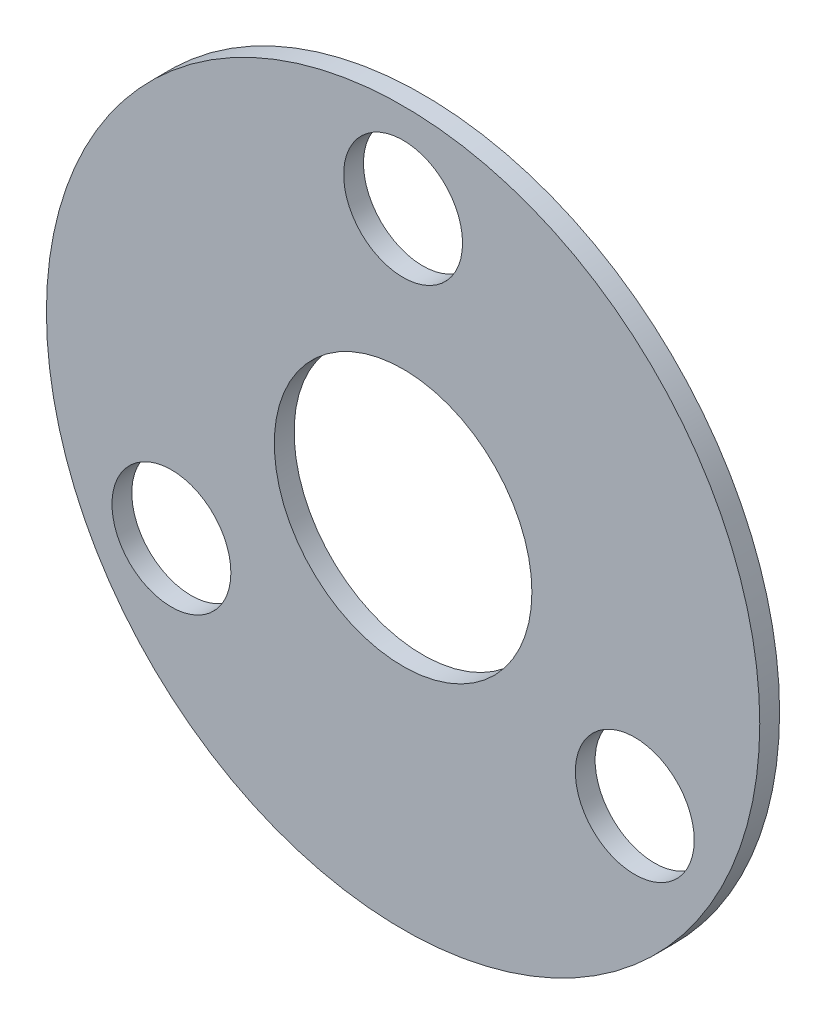
ISO-10303-21;
HEADER;
FILE_DESCRIPTION(('STEP AP214'),'2;1');
FILE_NAME('part.step','',(''),(''),'','','');
FILE_SCHEMA(('AUTOMOTIVE_DESIGN { 1 0 10303 214 1 1 1 1 }'));
ENDSEC;
DATA;
#1=APPLICATION_CONTEXT('core data for automotive mechanical design processes');
#2=APPLICATION_PROTOCOL_DEFINITION('international standard','automotive_design',2000,#1);
#3=PRODUCT_CONTEXT('',#1,'mechanical');
#4=PRODUCT('Part','Part','',(#3));
#5=PRODUCT_RELATED_PRODUCT_CATEGORY('part','',(#4));
#6=PRODUCT_DEFINITION_FORMATION('','',#4);
#7=PRODUCT_DEFINITION_CONTEXT('part definition',#1,'design');
#8=PRODUCT_DEFINITION('design','',#6,#7);
#9=PRODUCT_DEFINITION_SHAPE('','',#8);
#10=(LENGTH_UNIT() NAMED_UNIT(*) SI_UNIT(.MILLI.,.METRE.));
#11=(NAMED_UNIT(*) PLANE_ANGLE_UNIT() SI_UNIT($,.RADIAN.));
#12=(NAMED_UNIT(*) SI_UNIT($,.STERADIAN.) SOLID_ANGLE_UNIT());
#13=UNCERTAINTY_MEASURE_WITH_UNIT(LENGTH_MEASURE(1.E-05),#10,'distance_accuracy_value','');
#14=(GEOMETRIC_REPRESENTATION_CONTEXT(3) GLOBAL_UNCERTAINTY_ASSIGNED_CONTEXT((#13)) GLOBAL_UNIT_ASSIGNED_CONTEXT((#10,
#11,#12)) REPRESENTATION_CONTEXT('',''));
#15=CARTESIAN_POINT('',(0.,0.,0.));
#16=DIRECTION('',(0.,0.,1.));
#17=DIRECTION('',(1.,0.,0.));
#18=AXIS2_PLACEMENT_3D('',#15,#16,#17);
#19=CARTESIAN_POINT('',(0.,0.,1.));
#20=DIRECTION('',(0.,0.,-1.));
#21=DIRECTION('',(-1.,0.,0.));
#22=AXIS2_PLACEMENT_3D('',#19,#20,#21);
#23=CYLINDRICAL_SURFACE('',#22,18.);
#24=CARTESIAN_POINT('',(0.,0.,1.));
#25=DIRECTION('',(0.,0.,1.));
#26=DIRECTION('',(1.,0.,0.));
#27=AXIS2_PLACEMENT_3D('',#24,#25,#26);
#28=CIRCLE('',#27,18.);
#29=CARTESIAN_POINT('',(18.,0.,1.));
#30=VERTEX_POINT('',#29);
#31=EDGE_CURVE('E10',#30,#30,#28,.T.);
#32=ORIENTED_EDGE('',*,*,#31,.F.);
#33=EDGE_LOOP('',(#32));
#34=FACE_BOUND('',#33,.T.);
#35=CARTESIAN_POINT('',(0.,0.,0.));
#36=DIRECTION('',(0.,0.,1.));
#37=DIRECTION('',(1.,0.,0.));
#38=AXIS2_PLACEMENT_3D('',#35,#36,#37);
#39=CIRCLE('',#38,18.);
#40=CARTESIAN_POINT('',(18.,0.,0.));
#41=VERTEX_POINT('',#40);
#42=EDGE_CURVE('E34',#41,#41,#39,.T.);
#43=ORIENTED_EDGE('',*,*,#42,.T.);
#44=EDGE_LOOP('',(#43));
#45=FACE_BOUND('',#44,.T.);
#46=ADVANCED_FACE('F31',(#34,#45),#23,.T.);
#47=CARTESIAN_POINT('',(0.,0.,1.));
#48=DIRECTION('',(0.,0.,1.));
#49=DIRECTION('',(1.,0.,0.));
#50=AXIS2_PLACEMENT_3D('',#47,#48,#49);
#51=PLANE('',#50);
#52=CARTESIAN_POINT('',(0.,0.,1.));
#53=DIRECTION('',(0.,0.,1.));
#54=DIRECTION('',(1.,0.,0.));
#55=AXIS2_PLACEMENT_3D('',#52,#53,#54);
#56=CIRCLE('',#55,6.5);
#57=CARTESIAN_POINT('',(6.5,0.,1.));
#58=VERTEX_POINT('',#57);
#59=EDGE_CURVE('E58',#58,#58,#56,.T.);
#60=ORIENTED_EDGE('',*,*,#59,.F.);
#61=EDGE_LOOP('',(#60));
#62=FACE_BOUND('',#61,.T.);
#63=CARTESIAN_POINT('',(11.6913429510905,-6.74999999999967,1.));
#64=DIRECTION('',(0.,0.,1.));
#65=DIRECTION('',(1.,0.,0.));
#66=AXIS2_PLACEMENT_3D('',#63,#64,#65);
#67=CIRCLE('',#66,3.00000000000052);
#68=CARTESIAN_POINT('',(14.691342951091,-6.74999999999967,1.));
#69=VERTEX_POINT('',#68);
#70=EDGE_CURVE('E52',#69,#69,#67,.T.);
#71=ORIENTED_EDGE('',*,*,#70,.F.);
#72=EDGE_LOOP('',(#71));
#73=FACE_BOUND('',#72,.T.);
#74=CARTESIAN_POINT('',(-11.6913429510893,-6.75000000000034,1.));
#75=DIRECTION('',(0.,0.,1.));
#76=DIRECTION('',(1.,0.,0.));
#77=AXIS2_PLACEMENT_3D('',#74,#75,#76);
#78=CIRCLE('',#77,3.00000000000077);
#79=CARTESIAN_POINT('',(-8.69134295108858,-6.75000000000034,1.));
#80=VERTEX_POINT('',#79);
#81=EDGE_CURVE('E46',#80,#80,#78,.T.);
#82=ORIENTED_EDGE('',*,*,#81,.F.);
#83=EDGE_LOOP('',(#82));
#84=FACE_BOUND('',#83,.T.);
#85=CARTESIAN_POINT('',(0.,13.5,1.));
#86=DIRECTION('',(0.,0.,1.));
#87=DIRECTION('',(1.,0.,0.));
#88=AXIS2_PLACEMENT_3D('',#85,#86,#87);
#89=CIRCLE('',#88,3.);
#90=CARTESIAN_POINT('',(3.,13.5,1.));
#91=VERTEX_POINT('',#90);
#92=EDGE_CURVE('E43',#91,#91,#89,.T.);
#93=ORIENTED_EDGE('',*,*,#92,.F.);
#94=EDGE_LOOP('',(#93));
#95=FACE_BOUND('',#94,.T.);
#96=ORIENTED_EDGE('',*,*,#31,.T.);
#97=EDGE_LOOP('',(#96));
#98=FACE_BOUND('',#97,.T.);
#99=ADVANCED_FACE('F69',(#62,#73,#84,#95,#98),#51,.T.);
#100=CARTESIAN_POINT('',(0.,0.,0.));
#101=DIRECTION('',(0.,0.,1.));
#102=DIRECTION('',(1.,0.,0.));
#103=AXIS2_PLACEMENT_3D('',#100,#101,#102);
#104=PLANE('',#103);
#105=CARTESIAN_POINT('',(0.,0.,0.));
#106=DIRECTION('',(0.,0.,1.));
#107=DIRECTION('',(1.,0.,0.));
#108=AXIS2_PLACEMENT_3D('',#105,#106,#107);
#109=CIRCLE('',#108,6.5);
#110=CARTESIAN_POINT('',(6.5,0.,0.));
#111=VERTEX_POINT('',#110);
#112=EDGE_CURVE('E61',#111,#111,#109,.T.);
#113=ORIENTED_EDGE('',*,*,#112,.T.);
#114=EDGE_LOOP('',(#113));
#115=FACE_BOUND('',#114,.T.);
#116=CARTESIAN_POINT('',(11.6913429510905,-6.74999999999967,0.));
#117=DIRECTION('',(0.,0.,1.));
#118=DIRECTION('',(1.,0.,0.));
#119=AXIS2_PLACEMENT_3D('',#116,#117,#118);
#120=CIRCLE('',#119,3.00000000000052);
#121=CARTESIAN_POINT('',(14.691342951091,-6.74999999999967,0.));
#122=VERTEX_POINT('',#121);
#123=EDGE_CURVE('E55',#122,#122,#120,.T.);
#124=ORIENTED_EDGE('',*,*,#123,.T.);
#125=EDGE_LOOP('',(#124));
#126=FACE_BOUND('',#125,.T.);
#127=CARTESIAN_POINT('',(-11.6913429510893,-6.75000000000034,0.));
#128=DIRECTION('',(0.,0.,1.));
#129=DIRECTION('',(1.,0.,0.));
#130=AXIS2_PLACEMENT_3D('',#127,#128,#129);
#131=CIRCLE('',#130,3.00000000000077);
#132=CARTESIAN_POINT('',(-8.69134295108858,-6.75000000000034,0.));
#133=VERTEX_POINT('',#132);
#134=EDGE_CURVE('E49',#133,#133,#131,.T.);
#135=ORIENTED_EDGE('',*,*,#134,.T.);
#136=EDGE_LOOP('',(#135));
#137=FACE_BOUND('',#136,.T.);
#138=CARTESIAN_POINT('',(0.,13.5,0.));
#139=DIRECTION('',(0.,0.,1.));
#140=DIRECTION('',(1.,0.,0.));
#141=AXIS2_PLACEMENT_3D('',#138,#139,#140);
#142=CIRCLE('',#141,3.);
#143=CARTESIAN_POINT('',(3.,13.5,0.));
#144=VERTEX_POINT('',#143);
#145=EDGE_CURVE('E41',#144,#144,#142,.T.);
#146=ORIENTED_EDGE('',*,*,#145,.T.);
#147=EDGE_LOOP('',(#146));
#148=FACE_BOUND('',#147,.T.);
#149=ORIENTED_EDGE('',*,*,#42,.F.);
#150=EDGE_LOOP('',(#149));
#151=FACE_BOUND('',#150,.T.);
#152=ADVANCED_FACE('F72',(#115,#126,#137,#148,#151),#104,.F.);
#153=CARTESIAN_POINT('',(0.,13.5,0.));
#154=DIRECTION('',(0.,0.,1.));
#155=DIRECTION('',(1.,0.,0.));
#156=AXIS2_PLACEMENT_3D('',#153,#154,#155);
#157=CYLINDRICAL_SURFACE('',#156,3.);
#158=ORIENTED_EDGE('',*,*,#145,.F.);
#159=EDGE_LOOP('',(#158));
#160=FACE_BOUND('',#159,.T.);
#161=ORIENTED_EDGE('',*,*,#92,.T.);
#162=EDGE_LOOP('',(#161));
#163=FACE_BOUND('',#162,.T.);
#164=ADVANCED_FACE('F80',(#160,#163),#157,.F.);
#165=CARTESIAN_POINT('',(-11.6913429510893,-6.75000000000034,0.));
#166=DIRECTION('',(0.,0.,1.));
#167=DIRECTION('',(1.,0.,0.));
#168=AXIS2_PLACEMENT_3D('',#165,#166,#167);
#169=CYLINDRICAL_SURFACE('',#168,3.00000000000077);
#170=ORIENTED_EDGE('',*,*,#134,.F.);
#171=EDGE_LOOP('',(#170));
#172=FACE_BOUND('',#171,.T.);
#173=ORIENTED_EDGE('',*,*,#81,.T.);
#174=EDGE_LOOP('',(#173));
#175=FACE_BOUND('',#174,.T.);
#176=ADVANCED_FACE('F82',(#172,#175),#169,.F.);
#177=CARTESIAN_POINT('',(11.6913429510905,-6.74999999999967,0.));
#178=DIRECTION('',(0.,0.,1.));
#179=DIRECTION('',(1.,0.,0.));
#180=AXIS2_PLACEMENT_3D('',#177,#178,#179);
#181=CYLINDRICAL_SURFACE('',#180,3.00000000000052);
#182=ORIENTED_EDGE('',*,*,#123,.F.);
#183=EDGE_LOOP('',(#182));
#184=FACE_BOUND('',#183,.T.);
#185=ORIENTED_EDGE('',*,*,#70,.T.);
#186=EDGE_LOOP('',(#185));
#187=FACE_BOUND('',#186,.T.);
#188=ADVANCED_FACE('F89',(#184,#187),#181,.F.);
#189=CARTESIAN_POINT('',(0.,0.,0.));
#190=DIRECTION('',(0.,0.,1.));
#191=DIRECTION('',(1.,0.,0.));
#192=AXIS2_PLACEMENT_3D('',#189,#190,#191);
#193=CYLINDRICAL_SURFACE('',#192,6.5);
#194=ORIENTED_EDGE('',*,*,#112,.F.);
#195=EDGE_LOOP('',(#194));
#196=FACE_BOUND('',#195,.T.);
#197=ORIENTED_EDGE('',*,*,#59,.T.);
#198=EDGE_LOOP('',(#197));
#199=FACE_BOUND('',#198,.T.);
#200=ADVANCED_FACE('F67',(#196,#199),#193,.F.);
#201=CLOSED_SHELL('',(#46,#99,#152,#164,#176,#188,#200));
#202=MANIFOLD_SOLID_BREP('B2',#201);
#203=ADVANCED_BREP_SHAPE_REPRESENTATION('',(#18,#202),#14);
#204=SHAPE_DEFINITION_REPRESENTATION(#9,#203);
ENDSEC;
END-ISO-10303-21;
